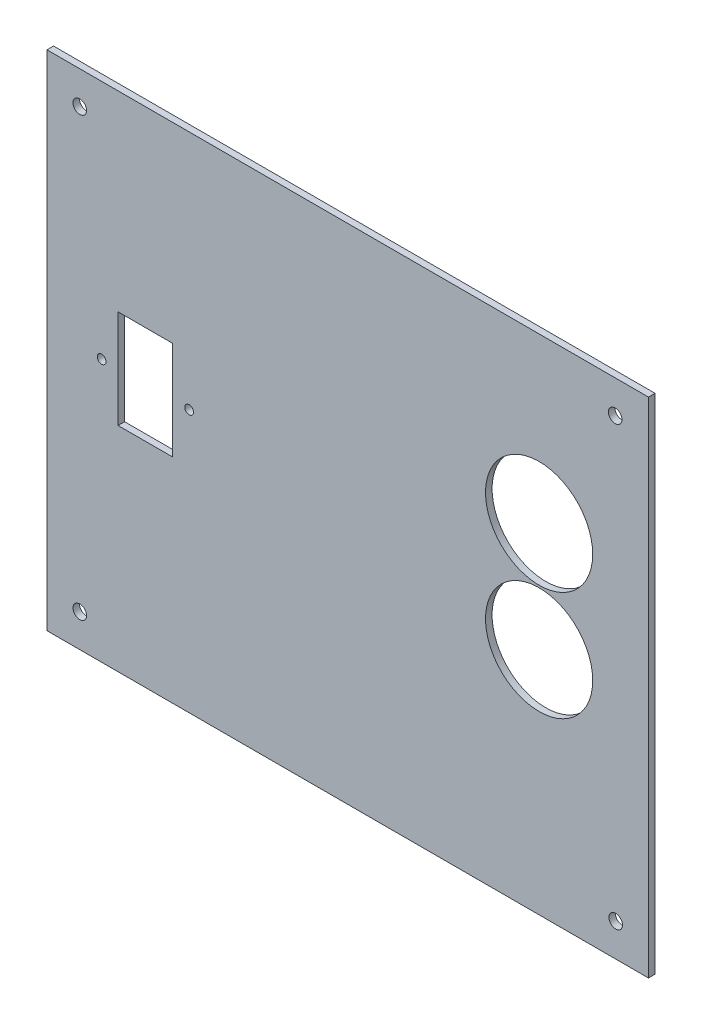
ISO-10303-21;
HEADER;
FILE_DESCRIPTION(('STEP AP214'),'2;1');
FILE_NAME('part.step','',(''),(''),'','','');
FILE_SCHEMA(('AUTOMOTIVE_DESIGN { 1 0 10303 214 1 1 1 1 }'));
ENDSEC;
DATA;
#1=APPLICATION_CONTEXT('core data for automotive mechanical design processes');
#2=APPLICATION_PROTOCOL_DEFINITION('international standard','automotive_design',2000,#1);
#3=PRODUCT_CONTEXT('',#1,'mechanical');
#4=PRODUCT('Part','Part','',(#3));
#5=PRODUCT_RELATED_PRODUCT_CATEGORY('part','',(#4));
#6=PRODUCT_DEFINITION_FORMATION('','',#4);
#7=PRODUCT_DEFINITION_CONTEXT('part definition',#1,'design');
#8=PRODUCT_DEFINITION('design','',#6,#7);
#9=PRODUCT_DEFINITION_SHAPE('','',#8);
#10=(LENGTH_UNIT() NAMED_UNIT(*) SI_UNIT(.MILLI.,.METRE.));
#11=(NAMED_UNIT(*) PLANE_ANGLE_UNIT() SI_UNIT($,.RADIAN.));
#12=(NAMED_UNIT(*) SI_UNIT($,.STERADIAN.) SOLID_ANGLE_UNIT());
#13=UNCERTAINTY_MEASURE_WITH_UNIT(LENGTH_MEASURE(1.E-05),#10,'distance_accuracy_value','');
#14=(GEOMETRIC_REPRESENTATION_CONTEXT(3) GLOBAL_UNCERTAINTY_ASSIGNED_CONTEXT((#13)) GLOBAL_UNIT_ASSIGNED_CONTEXT((#10,
#11,#12)) REPRESENTATION_CONTEXT('',''));
#15=CARTESIAN_POINT('',(0.,0.,0.));
#16=DIRECTION('',(0.,0.,1.));
#17=DIRECTION('',(1.,0.,0.));
#18=AXIS2_PLACEMENT_3D('',#15,#16,#17);
#19=CARTESIAN_POINT('',(0.,0.,3.));
#20=DIRECTION('',(0.,0.,1.));
#21=DIRECTION('',(1.,0.,0.));
#22=AXIS2_PLACEMENT_3D('',#19,#20,#21);
#23=PLANE('',#22);
#24=CARTESIAN_POINT('',(-72.5,5.,3.));
#25=DIRECTION('',(0.,0.,1.));
#26=DIRECTION('',(1.,0.,0.));
#27=AXIS2_PLACEMENT_3D('',#24,#25,#26);
#28=CIRCLE('',#27,2.);
#29=CARTESIAN_POINT('',(-70.5,5.,3.));
#30=VERTEX_POINT('',#29);
#31=EDGE_CURVE('E133',#30,#30,#28,.T.);
#32=ORIENTED_EDGE('',*,*,#31,.F.);
#33=EDGE_LOOP('',(#32));
#34=FACE_BOUND('',#33,.T.);
#35=CARTESIAN_POINT('',(-112.5,5.,3.));
#36=DIRECTION('',(0.,0.,1.));
#37=DIRECTION('',(1.,0.,0.));
#38=AXIS2_PLACEMENT_3D('',#35,#36,#37);
#39=CIRCLE('',#38,2.);
#40=CARTESIAN_POINT('',(-110.5,5.,3.));
#41=VERTEX_POINT('',#40);
#42=EDGE_CURVE('E345',#41,#41,#39,.T.);
#43=ORIENTED_EDGE('',*,*,#42,.F.);
#44=EDGE_LOOP('',(#43));
#45=FACE_BOUND('',#44,.T.);
#46=DIRECTION('',(0.,-1.,0.));
#47=VECTOR('',#46,1.);
#48=CARTESIAN_POINT('',(-105.,27.5,3.));
#49=LINE('',#48,#47);
#50=CARTESIAN_POINT('',(-105.,27.5,3.));
#51=VERTEX_POINT('',#50);
#52=CARTESIAN_POINT('',(-105.,-17.5,3.));
#53=VERTEX_POINT('',#52);
#54=EDGE_CURVE('E55',#51,#53,#49,.T.);
#55=ORIENTED_EDGE('',*,*,#54,.F.);
#56=DIRECTION('',(-1.,0.,0.));
#57=VECTOR('',#56,1.);
#58=CARTESIAN_POINT('',(-105.,27.5,3.));
#59=LINE('',#58,#57);
#60=CARTESIAN_POINT('',(-80.,27.5,3.));
#61=VERTEX_POINT('',#60);
#62=EDGE_CURVE('E126',#61,#51,#59,.T.);
#63=ORIENTED_EDGE('',*,*,#62,.F.);
#64=DIRECTION('',(0.,1.,0.));
#65=VECTOR('',#64,1.);
#66=CARTESIAN_POINT('',(-80.,27.5,3.));
#67=LINE('',#66,#65);
#68=CARTESIAN_POINT('',(-80.,-17.5,3.));
#69=VERTEX_POINT('',#68);
#70=EDGE_CURVE('E130',#69,#61,#67,.T.);
#71=ORIENTED_EDGE('',*,*,#70,.F.);
#72=DIRECTION('',(1.,0.,0.));
#73=VECTOR('',#72,1.);
#74=CARTESIAN_POINT('',(-105.,-17.5,3.));
#75=LINE('',#74,#73);
#76=EDGE_CURVE('E142',#53,#69,#75,.T.);
#77=ORIENTED_EDGE('',*,*,#76,.F.);
#78=EDGE_LOOP('',(#55,#63,#71,#77));
#79=FACE_BOUND('',#78,.T.);
#80=CARTESIAN_POINT('',(87.5,40.,3.));
#81=DIRECTION('',(0.,0.,1.));
#82=DIRECTION('',(1.,0.,0.));
#83=AXIS2_PLACEMENT_3D('',#80,#81,#82);
#84=CIRCLE('',#83,24.5);
#85=CARTESIAN_POINT('',(112.,40.,3.));
#86=VERTEX_POINT('',#85);
#87=EDGE_CURVE('E163',#86,#86,#84,.T.);
#88=ORIENTED_EDGE('',*,*,#87,.F.);
#89=EDGE_LOOP('',(#88));
#90=FACE_BOUND('',#89,.T.);
#91=CARTESIAN_POINT('',(87.5,-10.,3.));
#92=DIRECTION('',(0.,0.,1.));
#93=DIRECTION('',(1.,0.,0.));
#94=AXIS2_PLACEMENT_3D('',#91,#92,#93);
#95=CIRCLE('',#94,24.5);
#96=CARTESIAN_POINT('',(112.,-10.,3.));
#97=VERTEX_POINT('',#96);
#98=EDGE_CURVE('E152',#97,#97,#95,.T.);
#99=ORIENTED_EDGE('',*,*,#98,.F.);
#100=EDGE_LOOP('',(#99));
#101=FACE_BOUND('',#100,.T.);
#102=CARTESIAN_POINT('',(-122.5,-100.,3.));
#103=DIRECTION('',(0.,0.,1.));
#104=DIRECTION('',(1.,0.,0.));
#105=AXIS2_PLACEMENT_3D('',#102,#103,#104);
#106=CIRCLE('',#105,3.1);
#107=CARTESIAN_POINT('',(-119.4,-100.,3.));
#108=VERTEX_POINT('',#107);
#109=EDGE_CURVE('E182',#108,#108,#106,.T.);
#110=ORIENTED_EDGE('',*,*,#109,.F.);
#111=EDGE_LOOP('',(#110));
#112=FACE_BOUND('',#111,.T.);
#113=CARTESIAN_POINT('',(-122.5,100.,3.));
#114=DIRECTION('',(0.,0.,1.));
#115=DIRECTION('',(1.,0.,0.));
#116=AXIS2_PLACEMENT_3D('',#113,#114,#115);
#117=CIRCLE('',#116,3.1);
#118=CARTESIAN_POINT('',(-119.4,100.,3.));
#119=VERTEX_POINT('',#118);
#120=EDGE_CURVE('E198',#119,#119,#117,.T.);
#121=ORIENTED_EDGE('',*,*,#120,.F.);
#122=EDGE_LOOP('',(#121));
#123=FACE_BOUND('',#122,.T.);
#124=DIRECTION('',(0.,1.,0.));
#125=VECTOR('',#124,1.);
#126=CARTESIAN_POINT('',(137.5,115.,3.));
#127=LINE('',#126,#125);
#128=CARTESIAN_POINT('',(137.5,-115.,3.));
#129=VERTEX_POINT('',#128);
#130=CARTESIAN_POINT('',(137.5,115.,3.));
#131=VERTEX_POINT('',#130);
#132=EDGE_CURVE('E206',#129,#131,#127,.T.);
#133=ORIENTED_EDGE('',*,*,#132,.T.);
#134=DIRECTION('',(-1.,0.,0.));
#135=VECTOR('',#134,1.);
#136=CARTESIAN_POINT('',(-137.5,115.,3.));
#137=LINE('',#136,#135);
#138=CARTESIAN_POINT('',(-137.5,115.,3.));
#139=VERTEX_POINT('',#138);
#140=EDGE_CURVE('E210',#131,#139,#137,.T.);
#141=ORIENTED_EDGE('',*,*,#140,.T.);
#142=DIRECTION('',(0.,-1.,0.));
#143=VECTOR('',#142,1.);
#144=CARTESIAN_POINT('',(-137.5,115.,3.));
#145=LINE('',#144,#143);
#146=CARTESIAN_POINT('',(-137.5,-115.,3.));
#147=VERTEX_POINT('',#146);
#148=EDGE_CURVE('E214',#139,#147,#145,.T.);
#149=ORIENTED_EDGE('',*,*,#148,.T.);
#150=DIRECTION('',(1.,0.,0.));
#151=VECTOR('',#150,1.);
#152=CARTESIAN_POINT('',(-137.5,-115.,3.));
#153=LINE('',#152,#151);
#154=EDGE_CURVE('E217',#147,#129,#153,.T.);
#155=ORIENTED_EDGE('',*,*,#154,.T.);
#156=EDGE_LOOP('',(#133,#141,#149,#155));
#157=FACE_BOUND('',#156,.T.);
#158=CARTESIAN_POINT('',(122.275174874517,100.,3.));
#159=DIRECTION('',(0.,0.,1.));
#160=DIRECTION('',(1.,0.,0.));
#161=AXIS2_PLACEMENT_3D('',#158,#159,#160);
#162=CIRCLE('',#161,3.09999999999999);
#163=CARTESIAN_POINT('',(125.375174874517,100.,3.));
#164=VERTEX_POINT('',#163);
#165=EDGE_CURVE('E190',#164,#164,#162,.T.);
#166=ORIENTED_EDGE('',*,*,#165,.F.);
#167=EDGE_LOOP('',(#166));
#168=FACE_BOUND('',#167,.T.);
#169=CARTESIAN_POINT('',(122.500000000001,-99.9999999999971,3.));
#170=DIRECTION('',(0.,0.,1.));
#171=DIRECTION('',(1.,0.,0.));
#172=AXIS2_PLACEMENT_3D('',#169,#170,#171);
#173=CIRCLE('',#172,3.09999999999999);
#174=CARTESIAN_POINT('',(125.600000000001,-99.9999999999971,3.));
#175=VERTEX_POINT('',#174);
#176=EDGE_CURVE('E174',#175,#175,#173,.T.);
#177=ORIENTED_EDGE('',*,*,#176,.F.);
#178=EDGE_LOOP('',(#177));
#179=FACE_BOUND('',#178,.T.);
#180=ADVANCED_FACE('F39',(#34,#45,#79,#90,#101,#112,#123,#157,#168,#179),#23,.T.);
#181=CARTESIAN_POINT('',(0.,0.,0.));
#182=DIRECTION('',(0.,0.,1.));
#183=DIRECTION('',(1.,0.,0.));
#184=AXIS2_PLACEMENT_3D('',#181,#182,#183);
#185=PLANE('',#184);
#186=CARTESIAN_POINT('',(-72.5,5.,0.));
#187=DIRECTION('',(0.,0.,1.));
#188=DIRECTION('',(1.,0.,0.));
#189=AXIS2_PLACEMENT_3D('',#186,#187,#188);
#190=CIRCLE('',#189,2.);
#191=CARTESIAN_POINT('',(-70.5,5.,0.));
#192=VERTEX_POINT('',#191);
#193=EDGE_CURVE('E347',#192,#192,#190,.T.);
#194=ORIENTED_EDGE('',*,*,#193,.T.);
#195=EDGE_LOOP('',(#194));
#196=FACE_BOUND('',#195,.T.);
#197=CARTESIAN_POINT('',(-112.5,5.,0.));
#198=DIRECTION('',(0.,0.,1.));
#199=DIRECTION('',(1.,0.,0.));
#200=AXIS2_PLACEMENT_3D('',#197,#198,#199);
#201=CIRCLE('',#200,2.);
#202=CARTESIAN_POINT('',(-110.5,5.,0.));
#203=VERTEX_POINT('',#202);
#204=EDGE_CURVE('E143',#203,#203,#201,.T.);
#205=ORIENTED_EDGE('',*,*,#204,.T.);
#206=EDGE_LOOP('',(#205));
#207=FACE_BOUND('',#206,.T.);
#208=DIRECTION('',(-1.,0.,0.));
#209=VECTOR('',#208,1.);
#210=CARTESIAN_POINT('',(-105.,27.5,0.));
#211=LINE('',#210,#209);
#212=CARTESIAN_POINT('',(-80.,27.5,0.));
#213=VERTEX_POINT('',#212);
#214=CARTESIAN_POINT('',(-105.,27.5,0.));
#215=VERTEX_POINT('',#214);
#216=EDGE_CURVE('E114',#213,#215,#211,.T.);
#217=ORIENTED_EDGE('',*,*,#216,.T.);
#218=DIRECTION('',(0.,-1.,0.));
#219=VECTOR('',#218,1.);
#220=CARTESIAN_POINT('',(-105.,27.5,0.));
#221=LINE('',#220,#219);
#222=CARTESIAN_POINT('',(-105.,-17.5,0.));
#223=VERTEX_POINT('',#222);
#224=EDGE_CURVE('E107',#215,#223,#221,.T.);
#225=ORIENTED_EDGE('',*,*,#224,.T.);
#226=DIRECTION('',(1.,0.,0.));
#227=VECTOR('',#226,1.);
#228=CARTESIAN_POINT('',(-105.,-17.5,0.));
#229=LINE('',#228,#227);
#230=CARTESIAN_POINT('',(-80.,-17.5,0.));
#231=VERTEX_POINT('',#230);
#232=EDGE_CURVE('E117',#223,#231,#229,.T.);
#233=ORIENTED_EDGE('',*,*,#232,.T.);
#234=DIRECTION('',(0.,1.,0.));
#235=VECTOR('',#234,1.);
#236=CARTESIAN_POINT('',(-80.,27.5,0.));
#237=LINE('',#236,#235);
#238=EDGE_CURVE('E63',#231,#213,#237,.T.);
#239=ORIENTED_EDGE('',*,*,#238,.T.);
#240=EDGE_LOOP('',(#217,#225,#233,#239));
#241=FACE_BOUND('',#240,.T.);
#242=CARTESIAN_POINT('',(87.5,40.,0.));
#243=DIRECTION('',(0.,0.,1.));
#244=DIRECTION('',(1.,0.,0.));
#245=AXIS2_PLACEMENT_3D('',#242,#243,#244);
#246=CIRCLE('',#245,24.5);
#247=CARTESIAN_POINT('',(112.,40.,0.));
#248=VERTEX_POINT('',#247);
#249=EDGE_CURVE('E158',#248,#248,#246,.T.);
#250=ORIENTED_EDGE('',*,*,#249,.T.);
#251=EDGE_LOOP('',(#250));
#252=FACE_BOUND('',#251,.T.);
#253=CARTESIAN_POINT('',(87.5,-10.,0.));
#254=DIRECTION('',(0.,0.,1.));
#255=DIRECTION('',(1.,0.,0.));
#256=AXIS2_PLACEMENT_3D('',#253,#254,#255);
#257=CIRCLE('',#256,24.5);
#258=CARTESIAN_POINT('',(112.,-10.,0.));
#259=VERTEX_POINT('',#258);
#260=EDGE_CURVE('E167',#259,#259,#257,.T.);
#261=ORIENTED_EDGE('',*,*,#260,.T.);
#262=EDGE_LOOP('',(#261));
#263=FACE_BOUND('',#262,.T.);
#264=DIRECTION('',(0.,1.,0.));
#265=VECTOR('',#264,1.);
#266=CARTESIAN_POINT('',(137.5,115.,0.));
#267=LINE('',#266,#265);
#268=CARTESIAN_POINT('',(137.5,-115.,0.));
#269=VERTEX_POINT('',#268);
#270=CARTESIAN_POINT('',(137.5,115.,0.));
#271=VERTEX_POINT('',#270);
#272=EDGE_CURVE('E202',#269,#271,#267,.T.);
#273=ORIENTED_EDGE('',*,*,#272,.F.);
#274=DIRECTION('',(1.,0.,0.));
#275=VECTOR('',#274,1.);
#276=CARTESIAN_POINT('',(-137.5,-115.,0.));
#277=LINE('',#276,#275);
#278=CARTESIAN_POINT('',(-137.5,-115.,0.));
#279=VERTEX_POINT('',#278);
#280=EDGE_CURVE('E211',#279,#269,#277,.T.);
#281=ORIENTED_EDGE('',*,*,#280,.F.);
#282=DIRECTION('',(0.,-1.,0.));
#283=VECTOR('',#282,1.);
#284=CARTESIAN_POINT('',(-137.5,115.,0.));
#285=LINE('',#284,#283);
#286=CARTESIAN_POINT('',(-137.5,115.,0.));
#287=VERTEX_POINT('',#286);
#288=EDGE_CURVE('E227',#287,#279,#285,.T.);
#289=ORIENTED_EDGE('',*,*,#288,.F.);
#290=DIRECTION('',(-1.,0.,0.));
#291=VECTOR('',#290,1.);
#292=CARTESIAN_POINT('',(-137.5,115.,0.));
#293=LINE('',#292,#291);
#294=EDGE_CURVE('E224',#271,#287,#293,.T.);
#295=ORIENTED_EDGE('',*,*,#294,.F.);
#296=EDGE_LOOP('',(#273,#281,#289,#295));
#297=FACE_BOUND('',#296,.T.);
#298=CARTESIAN_POINT('',(-122.5,100.,0.));
#299=DIRECTION('',(0.,0.,1.));
#300=DIRECTION('',(1.,0.,0.));
#301=AXIS2_PLACEMENT_3D('',#298,#299,#300);
#302=CIRCLE('',#301,3.1);
#303=CARTESIAN_POINT('',(-119.4,100.,0.));
#304=VERTEX_POINT('',#303);
#305=EDGE_CURVE('E194',#304,#304,#302,.T.);
#306=ORIENTED_EDGE('',*,*,#305,.T.);
#307=EDGE_LOOP('',(#306));
#308=FACE_BOUND('',#307,.T.);
#309=CARTESIAN_POINT('',(122.275174874517,100.,0.));
#310=DIRECTION('',(0.,0.,1.));
#311=DIRECTION('',(1.,0.,0.));
#312=AXIS2_PLACEMENT_3D('',#309,#310,#311);
#313=CIRCLE('',#312,3.09999999999999);
#314=CARTESIAN_POINT('',(125.375174874517,100.,0.));
#315=VERTEX_POINT('',#314);
#316=EDGE_CURVE('E186',#315,#315,#313,.T.);
#317=ORIENTED_EDGE('',*,*,#316,.T.);
#318=EDGE_LOOP('',(#317));
#319=FACE_BOUND('',#318,.T.);
#320=CARTESIAN_POINT('',(-122.5,-100.,0.));
#321=DIRECTION('',(0.,0.,1.));
#322=DIRECTION('',(1.,0.,0.));
#323=AXIS2_PLACEMENT_3D('',#320,#321,#322);
#324=CIRCLE('',#323,3.1);
#325=CARTESIAN_POINT('',(-119.4,-100.,0.));
#326=VERTEX_POINT('',#325);
#327=EDGE_CURVE('E178',#326,#326,#324,.T.);
#328=ORIENTED_EDGE('',*,*,#327,.T.);
#329=EDGE_LOOP('',(#328));
#330=FACE_BOUND('',#329,.T.);
#331=CARTESIAN_POINT('',(122.500000000001,-99.9999999999971,0.));
#332=DIRECTION('',(0.,0.,1.));
#333=DIRECTION('',(1.,0.,0.));
#334=AXIS2_PLACEMENT_3D('',#331,#332,#333);
#335=CIRCLE('',#334,3.09999999999999);
#336=CARTESIAN_POINT('',(125.600000000001,-99.9999999999971,0.));
#337=VERTEX_POINT('',#336);
#338=EDGE_CURVE('E162',#337,#337,#335,.T.);
#339=ORIENTED_EDGE('',*,*,#338,.T.);
#340=EDGE_LOOP('',(#339));
#341=FACE_BOUND('',#340,.T.);
#342=ADVANCED_FACE('F122',(#196,#207,#241,#252,#263,#297,#308,#319,#330,#341),#185,.F.);
#343=CARTESIAN_POINT('',(137.5,115.,3.));
#344=DIRECTION('',(-1.,0.,0.));
#345=DIRECTION('',(0.,-1.,0.));
#346=AXIS2_PLACEMENT_3D('',#343,#344,#345);
#347=PLANE('',#346);
#348=ORIENTED_EDGE('',*,*,#272,.T.);
#349=DIRECTION('',(0.,0.,-1.));
#350=VECTOR('',#349,1.);
#351=CARTESIAN_POINT('',(137.5,115.,3.));
#352=LINE('',#351,#350);
#353=EDGE_CURVE('E11',#131,#271,#352,.T.);
#354=ORIENTED_EDGE('',*,*,#353,.F.);
#355=ORIENTED_EDGE('',*,*,#132,.F.);
#356=DIRECTION('',(0.,0.,-1.));
#357=VECTOR('',#356,1.);
#358=CARTESIAN_POINT('',(137.5,-115.,3.));
#359=LINE('',#358,#357);
#360=EDGE_CURVE('E220',#129,#269,#359,.T.);
#361=ORIENTED_EDGE('',*,*,#360,.T.);
#362=EDGE_LOOP('',(#348,#354,#355,#361));
#363=FACE_BOUND('',#362,.T.);
#364=ADVANCED_FACE('F41',(#363),#347,.F.);
#365=CARTESIAN_POINT('',(-137.5,115.,3.));
#366=DIRECTION('',(0.,-1.,0.));
#367=DIRECTION('',(0.,0.,-1.));
#368=AXIS2_PLACEMENT_3D('',#365,#366,#367);
#369=PLANE('',#368);
#370=ORIENTED_EDGE('',*,*,#294,.T.);
#371=DIRECTION('',(0.,0.,-1.));
#372=VECTOR('',#371,1.);
#373=CARTESIAN_POINT('',(-137.5,115.,3.));
#374=LINE('',#373,#372);
#375=EDGE_CURVE('E48',#139,#287,#374,.T.);
#376=ORIENTED_EDGE('',*,*,#375,.F.);
#377=ORIENTED_EDGE('',*,*,#140,.F.);
#378=ORIENTED_EDGE('',*,*,#353,.T.);
#379=EDGE_LOOP('',(#370,#376,#377,#378));
#380=FACE_BOUND('',#379,.T.);
#381=ADVANCED_FACE('F260',(#380),#369,.F.);
#382=CARTESIAN_POINT('',(-137.5,115.,3.));
#383=DIRECTION('',(1.,0.,0.));
#384=DIRECTION('',(0.,1.,0.));
#385=AXIS2_PLACEMENT_3D('',#382,#383,#384);
#386=PLANE('',#385);
#387=ORIENTED_EDGE('',*,*,#288,.T.);
#388=DIRECTION('',(0.,0.,-1.));
#389=VECTOR('',#388,1.);
#390=CARTESIAN_POINT('',(-137.5,-115.,3.));
#391=LINE('',#390,#389);
#392=EDGE_CURVE('E235',#147,#279,#391,.T.);
#393=ORIENTED_EDGE('',*,*,#392,.F.);
#394=ORIENTED_EDGE('',*,*,#148,.F.);
#395=ORIENTED_EDGE('',*,*,#375,.T.);
#396=EDGE_LOOP('',(#387,#393,#394,#395));
#397=FACE_BOUND('',#396,.T.);
#398=ADVANCED_FACE('F244',(#397),#386,.F.);
#399=CARTESIAN_POINT('',(-137.5,-115.,3.));
#400=DIRECTION('',(0.,1.,0.));
#401=DIRECTION('',(0.,0.,1.));
#402=AXIS2_PLACEMENT_3D('',#399,#400,#401);
#403=PLANE('',#402);
#404=ORIENTED_EDGE('',*,*,#280,.T.);
#405=ORIENTED_EDGE('',*,*,#360,.F.);
#406=ORIENTED_EDGE('',*,*,#154,.F.);
#407=ORIENTED_EDGE('',*,*,#392,.T.);
#408=EDGE_LOOP('',(#404,#405,#406,#407));
#409=FACE_BOUND('',#408,.T.);
#410=ADVANCED_FACE('F253',(#409),#403,.F.);
#411=CARTESIAN_POINT('',(-122.5,100.,3.));
#412=DIRECTION('',(0.,0.,-1.));
#413=DIRECTION('',(-1.,0.,0.));
#414=AXIS2_PLACEMENT_3D('',#411,#412,#413);
#415=CYLINDRICAL_SURFACE('',#414,3.1);
#416=ORIENTED_EDGE('',*,*,#120,.T.);
#417=EDGE_LOOP('',(#416));
#418=FACE_BOUND('',#417,.T.);
#419=ORIENTED_EDGE('',*,*,#305,.F.);
#420=EDGE_LOOP('',(#419));
#421=FACE_BOUND('',#420,.T.);
#422=ADVANCED_FACE('F278',(#418,#421),#415,.F.);
#423=CARTESIAN_POINT('',(122.275174874517,100.,3.));
#424=DIRECTION('',(0.,0.,-1.));
#425=DIRECTION('',(-1.,0.,0.));
#426=AXIS2_PLACEMENT_3D('',#423,#424,#425);
#427=CYLINDRICAL_SURFACE('',#426,3.09999999999999);
#428=ORIENTED_EDGE('',*,*,#165,.T.);
#429=EDGE_LOOP('',(#428));
#430=FACE_BOUND('',#429,.T.);
#431=ORIENTED_EDGE('',*,*,#316,.F.);
#432=EDGE_LOOP('',(#431));
#433=FACE_BOUND('',#432,.T.);
#434=ADVANCED_FACE('F285',(#430,#433),#427,.F.);
#435=CARTESIAN_POINT('',(-122.5,-100.,3.));
#436=DIRECTION('',(0.,0.,-1.));
#437=DIRECTION('',(-1.,0.,0.));
#438=AXIS2_PLACEMENT_3D('',#435,#436,#437);
#439=CYLINDRICAL_SURFACE('',#438,3.1);
#440=ORIENTED_EDGE('',*,*,#109,.T.);
#441=EDGE_LOOP('',(#440));
#442=FACE_BOUND('',#441,.T.);
#443=ORIENTED_EDGE('',*,*,#327,.F.);
#444=EDGE_LOOP('',(#443));
#445=FACE_BOUND('',#444,.T.);
#446=ADVANCED_FACE('F290',(#442,#445),#439,.F.);
#447=CARTESIAN_POINT('',(122.500000000001,-99.9999999999971,3.));
#448=DIRECTION('',(0.,0.,-1.));
#449=DIRECTION('',(-1.,0.,0.));
#450=AXIS2_PLACEMENT_3D('',#447,#448,#449);
#451=CYLINDRICAL_SURFACE('',#450,3.09999999999999);
#452=ORIENTED_EDGE('',*,*,#176,.T.);
#453=EDGE_LOOP('',(#452));
#454=FACE_BOUND('',#453,.T.);
#455=ORIENTED_EDGE('',*,*,#338,.F.);
#456=EDGE_LOOP('',(#455));
#457=FACE_BOUND('',#456,.T.);
#458=ADVANCED_FACE('F302',(#454,#457),#451,.F.);
#459=CARTESIAN_POINT('',(87.5,-10.,0.));
#460=DIRECTION('',(0.,0.,1.));
#461=DIRECTION('',(1.,0.,0.));
#462=AXIS2_PLACEMENT_3D('',#459,#460,#461);
#463=CYLINDRICAL_SURFACE('',#462,24.5);
#464=ORIENTED_EDGE('',*,*,#260,.F.);
#465=EDGE_LOOP('',(#464));
#466=FACE_BOUND('',#465,.T.);
#467=ORIENTED_EDGE('',*,*,#98,.T.);
#468=EDGE_LOOP('',(#467));
#469=FACE_BOUND('',#468,.T.);
#470=ADVANCED_FACE('F304',(#466,#469),#463,.F.);
#471=CARTESIAN_POINT('',(87.5,40.,0.));
#472=DIRECTION('',(0.,0.,1.));
#473=DIRECTION('',(1.,0.,0.));
#474=AXIS2_PLACEMENT_3D('',#471,#472,#473);
#475=CYLINDRICAL_SURFACE('',#474,24.5);
#476=ORIENTED_EDGE('',*,*,#249,.F.);
#477=EDGE_LOOP('',(#476));
#478=FACE_BOUND('',#477,.T.);
#479=ORIENTED_EDGE('',*,*,#87,.T.);
#480=EDGE_LOOP('',(#479));
#481=FACE_BOUND('',#480,.T.);
#482=ADVANCED_FACE('F311',(#478,#481),#475,.F.);
#483=CARTESIAN_POINT('',(-105.,27.5,0.));
#484=DIRECTION('',(-1.,0.,0.));
#485=DIRECTION('',(0.,0.,1.));
#486=AXIS2_PLACEMENT_3D('',#483,#484,#485);
#487=PLANE('',#486);
#488=ORIENTED_EDGE('',*,*,#54,.T.);
#489=DIRECTION('',(0.,0.,1.));
#490=VECTOR('',#489,1.);
#491=CARTESIAN_POINT('',(-105.,-17.5,0.));
#492=LINE('',#491,#490);
#493=EDGE_CURVE('E103',#223,#53,#492,.T.);
#494=ORIENTED_EDGE('',*,*,#493,.F.);
#495=ORIENTED_EDGE('',*,*,#224,.F.);
#496=DIRECTION('',(0.,0.,1.));
#497=VECTOR('',#496,1.);
#498=CARTESIAN_POINT('',(-105.,27.5,0.));
#499=LINE('',#498,#497);
#500=EDGE_CURVE('E149',#215,#51,#499,.T.);
#501=ORIENTED_EDGE('',*,*,#500,.T.);
#502=EDGE_LOOP('',(#488,#494,#495,#501));
#503=FACE_BOUND('',#502,.T.);
#504=ADVANCED_FACE('F105',(#503),#487,.F.);
#505=CARTESIAN_POINT('',(-105.,27.5,0.));
#506=DIRECTION('',(0.,1.,0.));
#507=DIRECTION('',(0.,0.,1.));
#508=AXIS2_PLACEMENT_3D('',#505,#506,#507);
#509=PLANE('',#508);
#510=ORIENTED_EDGE('',*,*,#62,.T.);
#511=ORIENTED_EDGE('',*,*,#500,.F.);
#512=ORIENTED_EDGE('',*,*,#216,.F.);
#513=DIRECTION('',(0.,0.,1.));
#514=VECTOR('',#513,1.);
#515=CARTESIAN_POINT('',(-80.,27.5,0.));
#516=LINE('',#515,#514);
#517=EDGE_CURVE('E153',#213,#61,#516,.T.);
#518=ORIENTED_EDGE('',*,*,#517,.T.);
#519=EDGE_LOOP('',(#510,#511,#512,#518));
#520=FACE_BOUND('',#519,.T.);
#521=ADVANCED_FACE('F322',(#520),#509,.F.);
#522=CARTESIAN_POINT('',(-80.,27.5,0.));
#523=DIRECTION('',(1.,0.,0.));
#524=DIRECTION('',(0.,0.,-1.));
#525=AXIS2_PLACEMENT_3D('',#522,#523,#524);
#526=PLANE('',#525);
#527=ORIENTED_EDGE('',*,*,#70,.T.);
#528=ORIENTED_EDGE('',*,*,#517,.F.);
#529=ORIENTED_EDGE('',*,*,#238,.F.);
#530=DIRECTION('',(0.,0.,1.));
#531=VECTOR('',#530,1.);
#532=CARTESIAN_POINT('',(-80.,-17.5,0.));
#533=LINE('',#532,#531);
#534=EDGE_CURVE('E113',#231,#69,#533,.T.);
#535=ORIENTED_EDGE('',*,*,#534,.T.);
#536=EDGE_LOOP('',(#527,#528,#529,#535));
#537=FACE_BOUND('',#536,.T.);
#538=ADVANCED_FACE('F326',(#537),#526,.F.);
#539=CARTESIAN_POINT('',(-105.,-17.5,0.));
#540=DIRECTION('',(0.,-1.,0.));
#541=DIRECTION('',(0.,0.,-1.));
#542=AXIS2_PLACEMENT_3D('',#539,#540,#541);
#543=PLANE('',#542);
#544=ORIENTED_EDGE('',*,*,#76,.T.);
#545=ORIENTED_EDGE('',*,*,#534,.F.);
#546=ORIENTED_EDGE('',*,*,#232,.F.);
#547=ORIENTED_EDGE('',*,*,#493,.T.);
#548=EDGE_LOOP('',(#544,#545,#546,#547));
#549=FACE_BOUND('',#548,.T.);
#550=ADVANCED_FACE('F118',(#549),#543,.F.);
#551=CARTESIAN_POINT('',(-112.5,5.,0.));
#552=DIRECTION('',(0.,0.,1.));
#553=DIRECTION('',(1.,0.,0.));
#554=AXIS2_PLACEMENT_3D('',#551,#552,#553);
#555=CYLINDRICAL_SURFACE('',#554,2.);
#556=ORIENTED_EDGE('',*,*,#204,.F.);
#557=EDGE_LOOP('',(#556));
#558=FACE_BOUND('',#557,.T.);
#559=ORIENTED_EDGE('',*,*,#42,.T.);
#560=EDGE_LOOP('',(#559));
#561=FACE_BOUND('',#560,.T.);
#562=ADVANCED_FACE('F325',(#558,#561),#555,.F.);
#563=CARTESIAN_POINT('',(-72.5,5.,0.));
#564=DIRECTION('',(0.,0.,1.));
#565=DIRECTION('',(1.,0.,0.));
#566=AXIS2_PLACEMENT_3D('',#563,#564,#565);
#567=CYLINDRICAL_SURFACE('',#566,2.);
#568=ORIENTED_EDGE('',*,*,#193,.F.);
#569=EDGE_LOOP('',(#568));
#570=FACE_BOUND('',#569,.T.);
#571=ORIENTED_EDGE('',*,*,#31,.T.);
#572=EDGE_LOOP('',(#571));
#573=FACE_BOUND('',#572,.T.);
#574=ADVANCED_FACE('F332',(#570,#573),#567,.F.);
#575=CLOSED_SHELL('',(#180,#342,#364,#381,#398,#410,#422,#434,#446,#458,#470,#482,#504,#521,
#538,#550,#562,#574));
#576=MANIFOLD_SOLID_BREP('B2',#575);
#577=ADVANCED_BREP_SHAPE_REPRESENTATION('',(#18,#576),#14);
#578=SHAPE_DEFINITION_REPRESENTATION(#9,#577);
ENDSEC;
END-ISO-10303-21;
